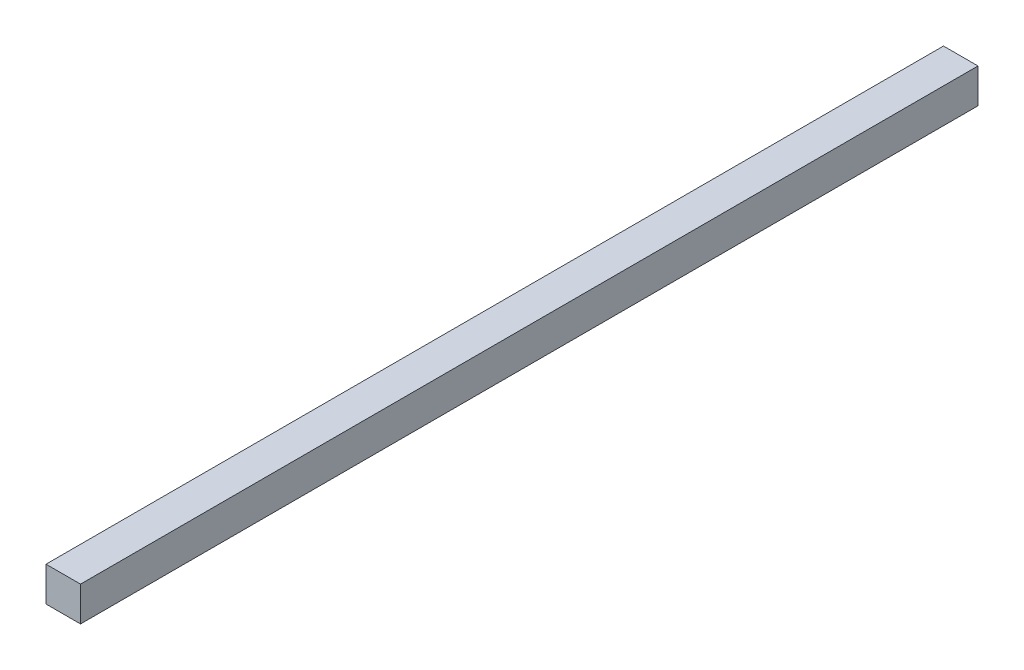
ISO-10303-21;
HEADER;
FILE_DESCRIPTION(('STEP AP214'),'2;1');
FILE_NAME('part.step','',(''),(''),'','','');
FILE_SCHEMA(('AUTOMOTIVE_DESIGN { 1 0 10303 214 1 1 1 1 }'));
ENDSEC;
DATA;
#1=APPLICATION_CONTEXT('core data for automotive mechanical design processes');
#2=APPLICATION_PROTOCOL_DEFINITION('international standard','automotive_design',2000,#1);
#3=PRODUCT_CONTEXT('',#1,'mechanical');
#4=PRODUCT('Part','Part','',(#3));
#5=PRODUCT_RELATED_PRODUCT_CATEGORY('part','',(#4));
#6=PRODUCT_DEFINITION_FORMATION('','',#4);
#7=PRODUCT_DEFINITION_CONTEXT('part definition',#1,'design');
#8=PRODUCT_DEFINITION('design','',#6,#7);
#9=PRODUCT_DEFINITION_SHAPE('','',#8);
#10=(LENGTH_UNIT() NAMED_UNIT(*) SI_UNIT(.MILLI.,.METRE.));
#11=(NAMED_UNIT(*) PLANE_ANGLE_UNIT() SI_UNIT($,.RADIAN.));
#12=(NAMED_UNIT(*) SI_UNIT($,.STERADIAN.) SOLID_ANGLE_UNIT());
#13=UNCERTAINTY_MEASURE_WITH_UNIT(LENGTH_MEASURE(1.E-05),#10,'distance_accuracy_value','');
#14=(GEOMETRIC_REPRESENTATION_CONTEXT(3) GLOBAL_UNCERTAINTY_ASSIGNED_CONTEXT((#13)) GLOBAL_UNIT_ASSIGNED_CONTEXT((#10,
#11,#12)) REPRESENTATION_CONTEXT('',''));
#15=CARTESIAN_POINT('',(0.,0.,0.));
#16=DIRECTION('',(0.,0.,1.));
#17=DIRECTION('',(1.,0.,0.));
#18=AXIS2_PLACEMENT_3D('',#15,#16,#17);
#19=CARTESIAN_POINT('',(12.7,-12.7,660.4));
#20=DIRECTION('',(-1.,0.,0.));
#21=DIRECTION('',(0.,0.,1.));
#22=AXIS2_PLACEMENT_3D('',#19,#20,#21);
#23=PLANE('',#22);
#24=DIRECTION('',(0.,1.,0.));
#25=VECTOR('',#24,1.);
#26=CARTESIAN_POINT('',(12.7,-12.7,0.));
#27=LINE('',#26,#25);
#28=CARTESIAN_POINT('',(12.7,-12.7,0.));
#29=VERTEX_POINT('',#28);
#30=CARTESIAN_POINT('',(12.7,12.7,0.));
#31=VERTEX_POINT('',#30);
#32=EDGE_CURVE('E113',#29,#31,#27,.T.);
#33=ORIENTED_EDGE('',*,*,#32,.T.);
#34=DIRECTION('',(0.,0.,-1.));
#35=VECTOR('',#34,1.);
#36=CARTESIAN_POINT('',(12.7,12.7,660.4));
#37=LINE('',#36,#35);
#38=CARTESIAN_POINT('',(12.7,12.7,660.4));
#39=VERTEX_POINT('',#38);
#40=EDGE_CURVE('E102',#39,#31,#37,.T.);
#41=ORIENTED_EDGE('',*,*,#40,.F.);
#42=DIRECTION('',(0.,1.,0.));
#43=VECTOR('',#42,1.);
#44=CARTESIAN_POINT('',(12.7,-12.7,660.4));
#45=LINE('',#44,#43);
#46=CARTESIAN_POINT('',(12.7,-12.7,660.4));
#47=VERTEX_POINT('',#46);
#48=EDGE_CURVE('E94',#47,#39,#45,.T.);
#49=ORIENTED_EDGE('',*,*,#48,.F.);
#50=DIRECTION('',(0.,0.,-1.));
#51=VECTOR('',#50,1.);
#52=CARTESIAN_POINT('',(12.7,-12.7,660.4));
#53=LINE('',#52,#51);
#54=EDGE_CURVE('E109',#47,#29,#53,.T.);
#55=ORIENTED_EDGE('',*,*,#54,.T.);
#56=EDGE_LOOP('',(#33,#41,#49,#55));
#57=FACE_BOUND('',#56,.T.);
#58=ADVANCED_FACE('F41',(#57),#23,.F.);
#59=CARTESIAN_POINT('',(-12.7,12.7,660.4));
#60=DIRECTION('',(0.,-1.,0.));
#61=DIRECTION('',(0.,0.,-1.));
#62=AXIS2_PLACEMENT_3D('',#59,#60,#61);
#63=PLANE('',#62);
#64=DIRECTION('',(-1.,0.,0.));
#65=VECTOR('',#64,1.);
#66=CARTESIAN_POINT('',(-12.7,12.7,0.));
#67=LINE('',#66,#65);
#68=CARTESIAN_POINT('',(-12.7,12.7,0.));
#69=VERTEX_POINT('',#68);
#70=EDGE_CURVE('E100',#31,#69,#67,.T.);
#71=ORIENTED_EDGE('',*,*,#70,.T.);
#72=DIRECTION('',(0.,0.,-1.));
#73=VECTOR('',#72,1.);
#74=CARTESIAN_POINT('',(-12.7,12.7,660.4));
#75=LINE('',#74,#73);
#76=CARTESIAN_POINT('',(-12.7,12.7,660.4));
#77=VERTEX_POINT('',#76);
#78=EDGE_CURVE('E98',#77,#69,#75,.T.);
#79=ORIENTED_EDGE('',*,*,#78,.F.);
#80=DIRECTION('',(-1.,0.,0.));
#81=VECTOR('',#80,1.);
#82=CARTESIAN_POINT('',(-12.7,12.7,660.4));
#83=LINE('',#82,#81);
#84=EDGE_CURVE('E89',#39,#77,#83,.T.);
#85=ORIENTED_EDGE('',*,*,#84,.F.);
#86=ORIENTED_EDGE('',*,*,#40,.T.);
#87=EDGE_LOOP('',(#71,#79,#85,#86));
#88=FACE_BOUND('',#87,.T.);
#89=ADVANCED_FACE('F99',(#88),#63,.F.);
#90=CARTESIAN_POINT('',(-12.7,-12.7,660.4));
#91=DIRECTION('',(1.,0.,0.));
#92=DIRECTION('',(0.,0.,-1.));
#93=AXIS2_PLACEMENT_3D('',#90,#91,#92);
#94=PLANE('',#93);
#95=CARTESIAN_POINT('',(-12.7,0.,12.7));
#96=DIRECTION('',(1.,0.,0.));
#97=DIRECTION('',(0.,0.,-1.));
#98=AXIS2_PLACEMENT_3D('',#95,#96,#97);
#99=CIRCLE('',#98,6.34999999999994);
#100=CARTESIAN_POINT('',(-12.7,0.,6.3500000000001));
#101=VERTEX_POINT('',#100);
#102=EDGE_CURVE('E11',#101,#101,#99,.F.);
#103=ORIENTED_EDGE('',*,*,#102,.F.);
#104=EDGE_LOOP('',(#103));
#105=FACE_BOUND('',#104,.T.);
#106=CARTESIAN_POINT('',(-12.7,0.,647.7));
#107=DIRECTION('',(1.,0.,0.));
#108=DIRECTION('',(0.,0.,-1.));
#109=AXIS2_PLACEMENT_3D('',#106,#107,#108);
#110=CIRCLE('',#109,6.34999999999994);
#111=CARTESIAN_POINT('',(-12.7,0.,641.35));
#112=VERTEX_POINT('',#111);
#113=EDGE_CURVE('E50',#112,#112,#110,.F.);
#114=ORIENTED_EDGE('',*,*,#113,.F.);
#115=EDGE_LOOP('',(#114));
#116=FACE_BOUND('',#115,.T.);
#117=DIRECTION('',(0.,-1.,0.));
#118=VECTOR('',#117,1.);
#119=CARTESIAN_POINT('',(-12.7,-12.7,0.));
#120=LINE('',#119,#118);
#121=CARTESIAN_POINT('',(-12.7,-12.7,0.));
#122=VERTEX_POINT('',#121);
#123=EDGE_CURVE('E75',#69,#122,#120,.T.);
#124=ORIENTED_EDGE('',*,*,#123,.T.);
#125=DIRECTION('',(0.,0.,-1.));
#126=VECTOR('',#125,1.);
#127=CARTESIAN_POINT('',(-12.7,-12.7,660.4));
#128=LINE('',#127,#126);
#129=CARTESIAN_POINT('',(-12.7,-12.7,660.4));
#130=VERTEX_POINT('',#129);
#131=EDGE_CURVE('E103',#130,#122,#128,.T.);
#132=ORIENTED_EDGE('',*,*,#131,.F.);
#133=DIRECTION('',(0.,-1.,0.));
#134=VECTOR('',#133,1.);
#135=CARTESIAN_POINT('',(-12.7,-12.7,660.4));
#136=LINE('',#135,#134);
#137=EDGE_CURVE('E92',#77,#130,#136,.T.);
#138=ORIENTED_EDGE('',*,*,#137,.F.);
#139=ORIENTED_EDGE('',*,*,#78,.T.);
#140=EDGE_LOOP('',(#124,#132,#138,#139));
#141=FACE_BOUND('',#140,.T.);
#142=ADVANCED_FACE('F105',(#105,#116,#141),#94,.F.);
#143=CARTESIAN_POINT('',(-12.7,-12.7,660.4));
#144=DIRECTION('',(0.,1.,0.));
#145=DIRECTION('',(0.,0.,1.));
#146=AXIS2_PLACEMENT_3D('',#143,#144,#145);
#147=PLANE('',#146);
#148=DIRECTION('',(1.,0.,0.));
#149=VECTOR('',#148,1.);
#150=CARTESIAN_POINT('',(-12.7,-12.7,0.));
#151=LINE('',#150,#149);
#152=EDGE_CURVE('E81',#122,#29,#151,.T.);
#153=ORIENTED_EDGE('',*,*,#152,.T.);
#154=ORIENTED_EDGE('',*,*,#54,.F.);
#155=DIRECTION('',(1.,0.,0.));
#156=VECTOR('',#155,1.);
#157=CARTESIAN_POINT('',(-12.7,-12.7,660.4));
#158=LINE('',#157,#156);
#159=EDGE_CURVE('E58',#130,#47,#158,.T.);
#160=ORIENTED_EDGE('',*,*,#159,.F.);
#161=ORIENTED_EDGE('',*,*,#131,.T.);
#162=EDGE_LOOP('',(#153,#154,#160,#161));
#163=FACE_BOUND('',#162,.T.);
#164=ADVANCED_FACE('F136',(#163),#147,.F.);
#165=CARTESIAN_POINT('',(0.,0.,660.4));
#166=DIRECTION('',(0.,0.,-1.));
#167=DIRECTION('',(-1.,0.,0.));
#168=AXIS2_PLACEMENT_3D('',#165,#166,#167);
#169=PLANE('',#168);
#170=ORIENTED_EDGE('',*,*,#48,.T.);
#171=ORIENTED_EDGE('',*,*,#84,.T.);
#172=ORIENTED_EDGE('',*,*,#137,.T.);
#173=ORIENTED_EDGE('',*,*,#159,.T.);
#174=EDGE_LOOP('',(#170,#171,#172,#173));
#175=FACE_BOUND('',#174,.T.);
#176=ADVANCED_FACE('F90',(#175),#169,.F.);
#177=CARTESIAN_POINT('',(0.,0.,0.));
#178=DIRECTION('',(0.,0.,-1.));
#179=DIRECTION('',(-1.,0.,0.));
#180=AXIS2_PLACEMENT_3D('',#177,#178,#179);
#181=PLANE('',#180);
#182=ORIENTED_EDGE('',*,*,#32,.F.);
#183=ORIENTED_EDGE('',*,*,#152,.F.);
#184=ORIENTED_EDGE('',*,*,#123,.F.);
#185=ORIENTED_EDGE('',*,*,#70,.F.);
#186=EDGE_LOOP('',(#182,#183,#184,#185));
#187=FACE_BOUND('',#186,.T.);
#188=ADVANCED_FACE('F151',(#187),#181,.T.);
#189=CARTESIAN_POINT('',(-12.8,0.,647.7));
#190=DIRECTION('',(1.,0.,0.));
#191=DIRECTION('',(0.,0.,-1.));
#192=AXIS2_PLACEMENT_3D('',#189,#190,#191);
#193=CYLINDRICAL_SURFACE('',#192,6.34999999999994);
#194=CARTESIAN_POINT('',(-12.8,0.,647.7));
#195=DIRECTION('',(-1.,0.,0.));
#196=DIRECTION('',(0.,0.,1.));
#197=AXIS2_PLACEMENT_3D('',#194,#195,#196);
#198=CIRCLE('',#197,6.34999999999994);
#199=CARTESIAN_POINT('',(-12.8,0.,654.05));
#200=VERTEX_POINT('',#199);
#201=EDGE_CURVE('E117',#200,#200,#198,.T.);
#202=ORIENTED_EDGE('',*,*,#201,.F.);
#203=EDGE_LOOP('',(#202));
#204=FACE_BOUND('',#203,.T.);
#205=ORIENTED_EDGE('',*,*,#113,.T.);
#206=EDGE_LOOP('',(#205));
#207=FACE_BOUND('',#206,.T.);
#208=ADVANCED_FACE('F133',(#204,#207),#193,.T.);
#209=CARTESIAN_POINT('',(-12.8,0.,647.7));
#210=DIRECTION('',(-1.,0.,0.));
#211=DIRECTION('',(0.,0.,1.));
#212=AXIS2_PLACEMENT_3D('',#209,#210,#211);
#213=PLANE('',#212);
#214=ORIENTED_EDGE('',*,*,#201,.T.);
#215=EDGE_LOOP('',(#214));
#216=FACE_BOUND('',#215,.T.);
#217=ADVANCED_FACE('F158',(#216),#213,.T.);
#218=CARTESIAN_POINT('',(-12.8,0.,12.7));
#219=DIRECTION('',(1.,0.,0.));
#220=DIRECTION('',(0.,0.,-1.));
#221=AXIS2_PLACEMENT_3D('',#218,#219,#220);
#222=CYLINDRICAL_SURFACE('',#221,6.34999999999994);
#223=CARTESIAN_POINT('',(-12.8,0.,12.7));
#224=DIRECTION('',(-1.,0.,0.));
#225=DIRECTION('',(0.,0.,-1.));
#226=AXIS2_PLACEMENT_3D('',#223,#224,#225);
#227=CIRCLE('',#226,6.34999999999994);
#228=CARTESIAN_POINT('',(-12.8,0.,6.3500000000001));
#229=VERTEX_POINT('',#228);
#230=EDGE_CURVE('E177',#229,#229,#227,.T.);
#231=ORIENTED_EDGE('',*,*,#230,.F.);
#232=EDGE_LOOP('',(#231));
#233=FACE_BOUND('',#232,.T.);
#234=ORIENTED_EDGE('',*,*,#102,.T.);
#235=EDGE_LOOP('',(#234));
#236=FACE_BOUND('',#235,.T.);
#237=ADVANCED_FACE('F165',(#233,#236),#222,.T.);
#238=CARTESIAN_POINT('',(-12.8,0.,12.7));
#239=DIRECTION('',(1.,0.,0.));
#240=DIRECTION('',(0.,0.,-1.));
#241=AXIS2_PLACEMENT_3D('',#238,#239,#240);
#242=PLANE('',#241);
#243=ORIENTED_EDGE('',*,*,#230,.T.);
#244=EDGE_LOOP('',(#243));
#245=FACE_BOUND('',#244,.T.);
#246=ADVANCED_FACE('F169',(#245),#242,.F.);
#247=CLOSED_SHELL('',(#58,#89,#142,#164,#176,#188,#208,#217,#237,#246));
#248=MANIFOLD_SOLID_BREP('B2',#247);
#249=ADVANCED_BREP_SHAPE_REPRESENTATION('',(#18,#248),#14);
#250=SHAPE_DEFINITION_REPRESENTATION(#9,#249);
ENDSEC;
END-ISO-10303-21;
